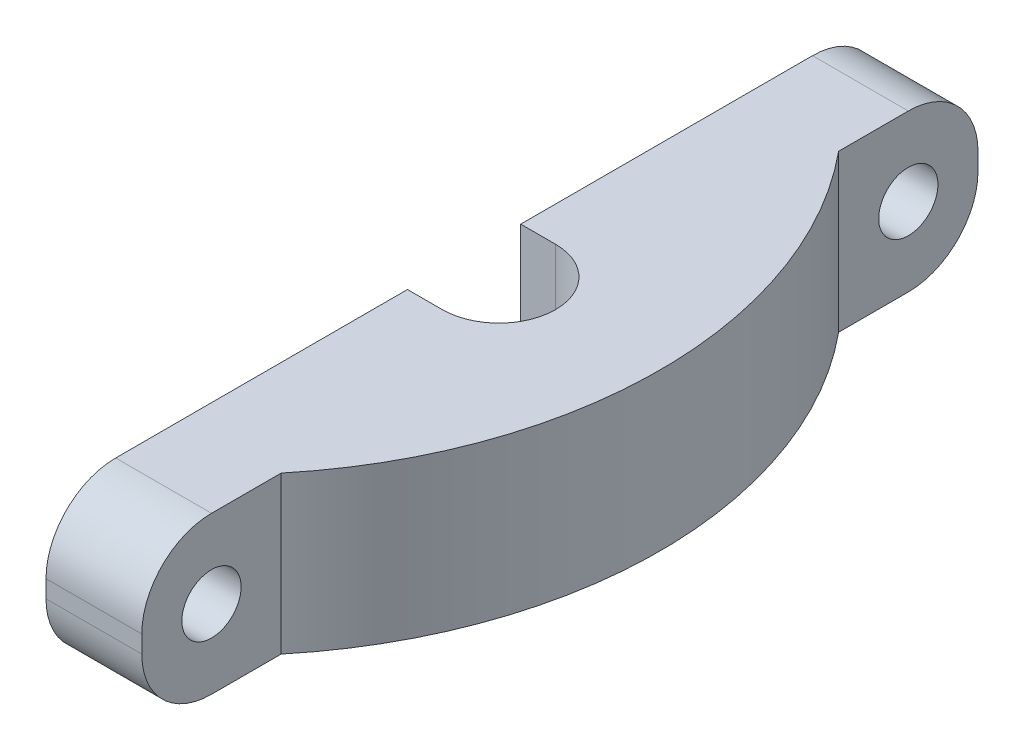
ISO-10303-21;
HEADER;
FILE_DESCRIPTION(('STEP AP214'),'2;1');
FILE_NAME('part.step','',(''),(''),'','','');
FILE_SCHEMA(('AUTOMOTIVE_DESIGN { 1 0 10303 214 1 1 1 1 }'));
ENDSEC;
DATA;
#1=APPLICATION_CONTEXT('core data for automotive mechanical design processes');
#2=APPLICATION_PROTOCOL_DEFINITION('international standard','automotive_design',2000,#1);
#3=PRODUCT_CONTEXT('',#1,'mechanical');
#4=PRODUCT('Part','Part','',(#3));
#5=PRODUCT_RELATED_PRODUCT_CATEGORY('part','',(#4));
#6=PRODUCT_DEFINITION_FORMATION('','',#4);
#7=PRODUCT_DEFINITION_CONTEXT('part definition',#1,'design');
#8=PRODUCT_DEFINITION('design','',#6,#7);
#9=PRODUCT_DEFINITION_SHAPE('','',#8);
#10=(LENGTH_UNIT() NAMED_UNIT(*) SI_UNIT(.MILLI.,.METRE.));
#11=(NAMED_UNIT(*) PLANE_ANGLE_UNIT() SI_UNIT($,.RADIAN.));
#12=(NAMED_UNIT(*) SI_UNIT($,.STERADIAN.) SOLID_ANGLE_UNIT());
#13=UNCERTAINTY_MEASURE_WITH_UNIT(LENGTH_MEASURE(1.E-05),#10,'distance_accuracy_value','');
#14=(GEOMETRIC_REPRESENTATION_CONTEXT(3) GLOBAL_UNCERTAINTY_ASSIGNED_CONTEXT((#13)) GLOBAL_UNIT_ASSIGNED_CONTEXT((#10,
#11,#12)) REPRESENTATION_CONTEXT('',''));
#15=CARTESIAN_POINT('',(0.,0.,0.));
#16=DIRECTION('',(0.,0.,1.));
#17=DIRECTION('',(1.,0.,0.));
#18=AXIS2_PLACEMENT_3D('',#15,#16,#17);
#19=CARTESIAN_POINT('',(11.25,-0.5,-20.));
#20=DIRECTION('',(-1.,0.,0.));
#21=DIRECTION('',(0.,0.,1.));
#22=AXIS2_PLACEMENT_3D('',#19,#20,#21);
#23=CYLINDRICAL_SURFACE('',#22,4.);
#24=CARTESIAN_POINT('',(5.5,-0.5,-20.));
#25=DIRECTION('',(1.,0.,0.));
#26=DIRECTION('',(0.,0.,-1.));
#27=AXIS2_PLACEMENT_3D('',#24,#25,#26);
#28=CIRCLE('',#27,4.);
#29=CARTESIAN_POINT('',(5.5,-4.5,-20.));
#30=VERTEX_POINT('',#29);
#31=CARTESIAN_POINT('',(5.5,-0.499999999999969,-24.));
#32=VERTEX_POINT('',#31);
#33=EDGE_CURVE('E178',#30,#32,#28,.T.);
#34=ORIENTED_EDGE('',*,*,#33,.F.);
#35=DIRECTION('',(-1.,0.,0.));
#36=VECTOR('',#35,1.);
#37=CARTESIAN_POINT('',(11.25,-4.5,-20.));
#38=LINE('',#37,#36);
#39=CARTESIAN_POINT('',(0.,-4.5,-20.));
#40=VERTEX_POINT('',#39);
#41=EDGE_CURVE('E255',#30,#40,#38,.T.);
#42=ORIENTED_EDGE('',*,*,#41,.T.);
#43=CARTESIAN_POINT('',(0.,-0.5,-20.));
#44=DIRECTION('',(1.,0.,0.));
#45=DIRECTION('',(0.,0.,1.));
#46=AXIS2_PLACEMENT_3D('',#43,#44,#45);
#47=CIRCLE('',#46,4.);
#48=CARTESIAN_POINT('',(0.,-0.499999999999969,-24.));
#49=VERTEX_POINT('',#48);
#50=EDGE_CURVE('E235',#40,#49,#47,.T.);
#51=ORIENTED_EDGE('',*,*,#50,.T.);
#52=DIRECTION('',(-1.,0.,0.));
#53=VECTOR('',#52,1.);
#54=CARTESIAN_POINT('',(11.25,-0.499999999999969,-24.));
#55=LINE('',#54,#53);
#56=EDGE_CURVE('E253',#32,#49,#55,.T.);
#57=ORIENTED_EDGE('',*,*,#56,.F.);
#58=EDGE_LOOP('',(#34,#42,#51,#57));
#59=FACE_BOUND('',#58,.T.);
#60=ADVANCED_FACE('F43',(#59),#23,.T.);
#61=CARTESIAN_POINT('',(11.25,0.499999999999974,-24.));
#62=DIRECTION('',(0.,0.,1.));
#63=DIRECTION('',(1.,0.,0.));
#64=AXIS2_PLACEMENT_3D('',#61,#62,#63);
#65=PLANE('',#64);
#66=DIRECTION('',(0.,-1.,0.));
#67=VECTOR('',#66,1.);
#68=CARTESIAN_POINT('',(5.5,4.5,-24.));
#69=LINE('',#68,#67);
#70=CARTESIAN_POINT('',(5.5,0.499999999999999,-24.));
#71=VERTEX_POINT('',#70);
#72=EDGE_CURVE('E171',#71,#32,#69,.T.);
#73=ORIENTED_EDGE('',*,*,#72,.T.);
#74=ORIENTED_EDGE('',*,*,#56,.T.);
#75=DIRECTION('',(0.,1.,0.));
#76=VECTOR('',#75,1.);
#77=CARTESIAN_POINT('',(0.,0.499999999999974,-24.));
#78=LINE('',#77,#76);
#79=CARTESIAN_POINT('',(0.,0.499999999999974,-24.));
#80=VERTEX_POINT('',#79);
#81=EDGE_CURVE('E238',#49,#80,#78,.T.);
#82=ORIENTED_EDGE('',*,*,#81,.T.);
#83=DIRECTION('',(-1.,0.,0.));
#84=VECTOR('',#83,1.);
#85=CARTESIAN_POINT('',(11.25,0.499999999999974,-24.));
#86=LINE('',#85,#84);
#87=EDGE_CURVE('E251',#71,#80,#86,.T.);
#88=ORIENTED_EDGE('',*,*,#87,.F.);
#89=EDGE_LOOP('',(#73,#74,#82,#88));
#90=FACE_BOUND('',#89,.T.);
#91=ADVANCED_FACE('F310',(#90),#65,.F.);
#92=CARTESIAN_POINT('',(11.25,0.499999999999999,-20.));
#93=DIRECTION('',(-1.,0.,0.));
#94=DIRECTION('',(0.,0.,1.));
#95=AXIS2_PLACEMENT_3D('',#92,#93,#94);
#96=CYLINDRICAL_SURFACE('',#95,4.);
#97=CARTESIAN_POINT('',(5.5,0.499999999999999,-20.));
#98=DIRECTION('',(1.,0.,0.));
#99=DIRECTION('',(0.,0.,-1.));
#100=AXIS2_PLACEMENT_3D('',#97,#98,#99);
#101=CIRCLE('',#100,4.);
#102=CARTESIAN_POINT('',(5.5,4.5,-20.));
#103=VERTEX_POINT('',#102);
#104=EDGE_CURVE('E165',#71,#103,#101,.T.);
#105=ORIENTED_EDGE('',*,*,#104,.F.);
#106=ORIENTED_EDGE('',*,*,#87,.T.);
#107=CARTESIAN_POINT('',(0.,0.499999999999999,-20.));
#108=DIRECTION('',(1.,0.,0.));
#109=DIRECTION('',(0.,0.,-1.));
#110=AXIS2_PLACEMENT_3D('',#107,#108,#109);
#111=CIRCLE('',#110,4.);
#112=CARTESIAN_POINT('',(0.,4.5,-20.));
#113=VERTEX_POINT('',#112);
#114=EDGE_CURVE('E241',#80,#113,#111,.T.);
#115=ORIENTED_EDGE('',*,*,#114,.T.);
#116=DIRECTION('',(-1.,0.,0.));
#117=VECTOR('',#116,1.);
#118=CARTESIAN_POINT('',(11.25,4.5,-20.));
#119=LINE('',#118,#117);
#120=EDGE_CURVE('E249',#103,#113,#119,.T.);
#121=ORIENTED_EDGE('',*,*,#120,.F.);
#122=EDGE_LOOP('',(#105,#106,#115,#121));
#123=FACE_BOUND('',#122,.T.);
#124=ADVANCED_FACE('F312',(#123),#96,.T.);
#125=CARTESIAN_POINT('',(11.25,0.,-20.));
#126=DIRECTION('',(1.,0.,0.));
#127=DIRECTION('',(0.,0.,-1.));
#128=AXIS2_PLACEMENT_3D('',#125,#126,#127);
#129=CYLINDRICAL_SURFACE('',#128,1.7);
#130=CARTESIAN_POINT('',(0.,0.,-20.));
#131=DIRECTION('',(1.,0.,0.));
#132=DIRECTION('',(0.,0.,-1.));
#133=AXIS2_PLACEMENT_3D('',#130,#131,#132);
#134=CIRCLE('',#133,1.7);
#135=CARTESIAN_POINT('',(0.,0.,-21.7));
#136=VERTEX_POINT('',#135);
#137=EDGE_CURVE('E196',#136,#136,#134,.T.);
#138=ORIENTED_EDGE('',*,*,#137,.F.);
#139=EDGE_LOOP('',(#138));
#140=FACE_BOUND('',#139,.T.);
#141=CARTESIAN_POINT('',(5.5,0.,-20.));
#142=DIRECTION('',(1.,0.,0.));
#143=DIRECTION('',(0.,0.,-1.));
#144=AXIS2_PLACEMENT_3D('',#141,#142,#143);
#145=CIRCLE('',#144,1.7);
#146=CARTESIAN_POINT('',(5.5,0.,-21.7));
#147=VERTEX_POINT('',#146);
#148=EDGE_CURVE('E47',#147,#147,#145,.F.);
#149=ORIENTED_EDGE('',*,*,#148,.F.);
#150=EDGE_LOOP('',(#149));
#151=FACE_BOUND('',#150,.T.);
#152=ADVANCED_FACE('F343',(#140,#151),#129,.F.);
#153=CARTESIAN_POINT('',(0.,0.5,20.));
#154=DIRECTION('',(-1.,0.,0.));
#155=DIRECTION('',(0.,0.,1.));
#156=AXIS2_PLACEMENT_3D('',#153,#154,#155);
#157=PLANE('',#156);
#158=ORIENTED_EDGE('',*,*,#137,.T.);
#159=EDGE_LOOP('',(#158));
#160=FACE_BOUND('',#159,.T.);
#161=DIRECTION('',(0.,-1.,0.));
#162=VECTOR('',#161,1.);
#163=CARTESIAN_POINT('',(0.,4.5,-3.25));
#164=LINE('',#163,#162);
#165=CARTESIAN_POINT('',(0.,4.5,-3.25));
#166=VERTEX_POINT('',#165);
#167=CARTESIAN_POINT('',(0.,-4.5,-3.25));
#168=VERTEX_POINT('',#167);
#169=EDGE_CURVE('E219',#166,#168,#164,.T.);
#170=ORIENTED_EDGE('',*,*,#169,.F.);
#171=DIRECTION('',(0.,0.,1.));
#172=VECTOR('',#171,1.);
#173=CARTESIAN_POINT('',(0.,4.5,-20.));
#174=LINE('',#173,#172);
#175=EDGE_CURVE('E245',#113,#166,#174,.T.);
#176=ORIENTED_EDGE('',*,*,#175,.F.);
#177=ORIENTED_EDGE('',*,*,#114,.F.);
#178=ORIENTED_EDGE('',*,*,#81,.F.);
#179=ORIENTED_EDGE('',*,*,#50,.F.);
#180=DIRECTION('',(0.,0.,-1.));
#181=VECTOR('',#180,1.);
#182=CARTESIAN_POINT('',(0.,-4.5,20.));
#183=LINE('',#182,#181);
#184=EDGE_CURVE('E231',#168,#40,#183,.T.);
#185=ORIENTED_EDGE('',*,*,#184,.F.);
#186=EDGE_LOOP('',(#170,#176,#177,#178,#179,#185));
#187=FACE_BOUND('',#186,.T.);
#188=ADVANCED_FACE('F301',(#160,#187),#157,.T.);
#189=CARTESIAN_POINT('',(11.25,0.5,20.));
#190=DIRECTION('',(-1.,0.,0.));
#191=DIRECTION('',(0.,0.,1.));
#192=AXIS2_PLACEMENT_3D('',#189,#190,#191);
#193=CYLINDRICAL_SURFACE('',#192,4.);
#194=DIRECTION('',(-1.,0.,0.));
#195=VECTOR('',#194,1.);
#196=CARTESIAN_POINT('',(11.25,0.499999999999969,24.));
#197=LINE('',#196,#195);
#198=CARTESIAN_POINT('',(5.5,0.499999999999969,24.));
#199=VERTEX_POINT('',#198);
#200=CARTESIAN_POINT('',(0.,0.499999999999969,24.));
#201=VERTEX_POINT('',#200);
#202=EDGE_CURVE('E11',#199,#201,#197,.T.);
#203=ORIENTED_EDGE('',*,*,#202,.F.);
#204=CARTESIAN_POINT('',(5.5,0.5,20.));
#205=DIRECTION('',(-1.,0.,0.));
#206=DIRECTION('',(0.,0.,1.));
#207=AXIS2_PLACEMENT_3D('',#204,#205,#206);
#208=CIRCLE('',#207,4.);
#209=CARTESIAN_POINT('',(5.5,4.5,20.));
#210=VERTEX_POINT('',#209);
#211=EDGE_CURVE('E191',#199,#210,#208,.T.);
#212=ORIENTED_EDGE('',*,*,#211,.T.);
#213=DIRECTION('',(-1.,0.,0.));
#214=VECTOR('',#213,1.);
#215=CARTESIAN_POINT('',(11.25,4.5,20.));
#216=LINE('',#215,#214);
#217=CARTESIAN_POINT('',(0.,4.5,20.));
#218=VERTEX_POINT('',#217);
#219=EDGE_CURVE('E68',#210,#218,#216,.T.);
#220=ORIENTED_EDGE('',*,*,#219,.T.);
#221=CARTESIAN_POINT('',(0.,0.5,20.));
#222=DIRECTION('',(1.,0.,0.));
#223=DIRECTION('',(0.,0.,1.));
#224=AXIS2_PLACEMENT_3D('',#221,#222,#223);
#225=CIRCLE('',#224,4.);
#226=EDGE_CURVE('E218',#218,#201,#225,.T.);
#227=ORIENTED_EDGE('',*,*,#226,.T.);
#228=EDGE_LOOP('',(#203,#212,#220,#227));
#229=FACE_BOUND('',#228,.T.);
#230=ADVANCED_FACE('F45',(#229),#193,.T.);
#231=CARTESIAN_POINT('',(11.25,0.499999999999969,24.));
#232=DIRECTION('',(0.,0.,-1.));
#233=DIRECTION('',(-1.,0.,0.));
#234=AXIS2_PLACEMENT_3D('',#231,#232,#233);
#235=PLANE('',#234);
#236=DIRECTION('',(-1.,0.,0.));
#237=VECTOR('',#236,1.);
#238=CARTESIAN_POINT('',(11.25,-0.499999999999974,24.));
#239=LINE('',#238,#237);
#240=CARTESIAN_POINT('',(5.5,-0.499999999999999,24.));
#241=VERTEX_POINT('',#240);
#242=CARTESIAN_POINT('',(0.,-0.499999999999974,24.));
#243=VERTEX_POINT('',#242);
#244=EDGE_CURVE('E52',#241,#243,#239,.T.);
#245=ORIENTED_EDGE('',*,*,#244,.F.);
#246=DIRECTION('',(0.,-1.,0.));
#247=VECTOR('',#246,1.);
#248=CARTESIAN_POINT('',(5.5,4.5,24.));
#249=LINE('',#248,#247);
#250=EDGE_CURVE('E157',#199,#241,#249,.T.);
#251=ORIENTED_EDGE('',*,*,#250,.F.);
#252=ORIENTED_EDGE('',*,*,#202,.T.);
#253=DIRECTION('',(0.,-1.,0.));
#254=VECTOR('',#253,1.);
#255=CARTESIAN_POINT('',(0.,0.499999999999969,24.));
#256=LINE('',#255,#254);
#257=EDGE_CURVE('E225',#201,#243,#256,.T.);
#258=ORIENTED_EDGE('',*,*,#257,.T.);
#259=EDGE_LOOP('',(#245,#251,#252,#258));
#260=FACE_BOUND('',#259,.T.);
#261=ADVANCED_FACE('F277',(#260),#235,.F.);
#262=CARTESIAN_POINT('',(11.25,-0.499999999999999,20.));
#263=DIRECTION('',(-1.,0.,0.));
#264=DIRECTION('',(0.,0.,1.));
#265=AXIS2_PLACEMENT_3D('',#262,#263,#264);
#266=CYLINDRICAL_SURFACE('',#265,4.);
#267=DIRECTION('',(-1.,0.,0.));
#268=VECTOR('',#267,1.);
#269=CARTESIAN_POINT('',(11.25,-4.5,20.));
#270=LINE('',#269,#268);
#271=CARTESIAN_POINT('',(5.5,-4.5,20.));
#272=VERTEX_POINT('',#271);
#273=CARTESIAN_POINT('',(0.,-4.5,20.));
#274=VERTEX_POINT('',#273);
#275=EDGE_CURVE('E257',#272,#274,#270,.T.);
#276=ORIENTED_EDGE('',*,*,#275,.F.);
#277=CARTESIAN_POINT('',(5.5,-0.499999999999999,20.));
#278=DIRECTION('',(-1.,0.,0.));
#279=DIRECTION('',(0.,0.,1.));
#280=AXIS2_PLACEMENT_3D('',#277,#278,#279);
#281=CIRCLE('',#280,4.);
#282=EDGE_CURVE('E188',#272,#241,#281,.T.);
#283=ORIENTED_EDGE('',*,*,#282,.T.);
#284=ORIENTED_EDGE('',*,*,#244,.T.);
#285=CARTESIAN_POINT('',(0.,-0.499999999999999,20.));
#286=DIRECTION('',(1.,0.,0.));
#287=DIRECTION('',(0.,0.,-1.));
#288=AXIS2_PLACEMENT_3D('',#285,#286,#287);
#289=CIRCLE('',#288,4.);
#290=EDGE_CURVE('E228',#243,#274,#289,.T.);
#291=ORIENTED_EDGE('',*,*,#290,.T.);
#292=EDGE_LOOP('',(#276,#283,#284,#291));
#293=FACE_BOUND('',#292,.T.);
#294=ADVANCED_FACE('F276',(#293),#266,.T.);
#295=CARTESIAN_POINT('',(11.25,-4.5,20.));
#296=DIRECTION('',(0.,1.,0.));
#297=DIRECTION('',(0.,0.,1.));
#298=AXIS2_PLACEMENT_3D('',#295,#296,#297);
#299=PLANE('',#298);
#300=DIRECTION('',(0.,0.,1.));
#301=VECTOR('',#300,1.);
#302=CARTESIAN_POINT('',(5.50000000000002,-4.5,0.));
#303=LINE('',#302,#301);
#304=CARTESIAN_POINT('',(5.50000000000001,-4.5,-16.));
#305=VERTEX_POINT('',#304);
#306=EDGE_CURVE('E166',#30,#305,#303,.T.);
#307=ORIENTED_EDGE('',*,*,#306,.T.);
#308=CARTESIAN_POINT('',(-13.8858695652174,-4.5,0.));
#309=DIRECTION('',(0.,-1.,0.));
#310=DIRECTION('',(0.,0.,-1.));
#311=AXIS2_PLACEMENT_3D('',#308,#309,#310);
#312=CIRCLE('',#311,25.1358695652174);
#313=CARTESIAN_POINT('',(5.5,-4.5,16.));
#314=VERTEX_POINT('',#313);
#315=EDGE_CURVE('E170',#314,#305,#312,.F.);
#316=ORIENTED_EDGE('',*,*,#315,.F.);
#317=DIRECTION('',(0.,0.,-1.));
#318=VECTOR('',#317,1.);
#319=CARTESIAN_POINT('',(5.5,-4.5,0.));
#320=LINE('',#319,#318);
#321=EDGE_CURVE('E180',#272,#314,#320,.T.);
#322=ORIENTED_EDGE('',*,*,#321,.F.);
#323=ORIENTED_EDGE('',*,*,#275,.T.);
#324=CARTESIAN_POINT('',(0.,-4.5,3.25));
#325=VERTEX_POINT('',#324);
#326=EDGE_CURVE('E232',#274,#325,#183,.T.);
#327=ORIENTED_EDGE('',*,*,#326,.T.);
#328=DIRECTION('',(-1.,0.,0.));
#329=VECTOR('',#328,1.);
#330=CARTESIAN_POINT('',(2.,-4.5,3.25));
#331=LINE('',#330,#329);
#332=CARTESIAN_POINT('',(2.,-4.5,3.25));
#333=VERTEX_POINT('',#332);
#334=EDGE_CURVE('E60',#333,#325,#331,.T.);
#335=ORIENTED_EDGE('',*,*,#334,.F.);
#336=CARTESIAN_POINT('',(2.,-4.5,0.));
#337=DIRECTION('',(0.,-1.,0.));
#338=DIRECTION('',(0.,0.,-1.));
#339=AXIS2_PLACEMENT_3D('',#336,#337,#338);
#340=CIRCLE('',#339,3.25);
#341=CARTESIAN_POINT('',(2.,-4.5,-3.25));
#342=VERTEX_POINT('',#341);
#343=EDGE_CURVE('E199',#342,#333,#340,.T.);
#344=ORIENTED_EDGE('',*,*,#343,.F.);
#345=DIRECTION('',(1.,0.,0.));
#346=VECTOR('',#345,1.);
#347=CARTESIAN_POINT('',(2.,-4.5,-3.25));
#348=LINE('',#347,#346);
#349=EDGE_CURVE('E204',#168,#342,#348,.T.);
#350=ORIENTED_EDGE('',*,*,#349,.F.);
#351=ORIENTED_EDGE('',*,*,#184,.T.);
#352=ORIENTED_EDGE('',*,*,#41,.F.);
#353=EDGE_LOOP('',(#307,#316,#322,#323,#327,#335,#344,#350,#351,#352));
#354=FACE_BOUND('',#353,.T.);
#355=ADVANCED_FACE('F286',(#354),#299,.F.);
#356=CARTESIAN_POINT('',(11.25,4.5,-20.));
#357=DIRECTION('',(0.,-1.,0.));
#358=DIRECTION('',(0.,0.,-1.));
#359=AXIS2_PLACEMENT_3D('',#356,#357,#358);
#360=PLANE('',#359);
#361=DIRECTION('',(0.,0.,1.));
#362=VECTOR('',#361,1.);
#363=CARTESIAN_POINT('',(5.50000000000002,4.5,0.));
#364=LINE('',#363,#362);
#365=CARTESIAN_POINT('',(5.50000000000001,4.5,-16.));
#366=VERTEX_POINT('',#365);
#367=EDGE_CURVE('E151',#103,#366,#364,.T.);
#368=ORIENTED_EDGE('',*,*,#367,.F.);
#369=ORIENTED_EDGE('',*,*,#120,.T.);
#370=ORIENTED_EDGE('',*,*,#175,.T.);
#371=DIRECTION('',(1.,0.,0.));
#372=VECTOR('',#371,1.);
#373=CARTESIAN_POINT('',(2.,4.5,-3.25));
#374=LINE('',#373,#372);
#375=CARTESIAN_POINT('',(2.,4.5,-3.25));
#376=VERTEX_POINT('',#375);
#377=EDGE_CURVE('E207',#166,#376,#374,.T.);
#378=ORIENTED_EDGE('',*,*,#377,.T.);
#379=CARTESIAN_POINT('',(2.,4.5,0.));
#380=DIRECTION('',(0.,-1.,0.));
#381=DIRECTION('',(0.,0.,-1.));
#382=AXIS2_PLACEMENT_3D('',#379,#380,#381);
#383=CIRCLE('',#382,3.25);
#384=CARTESIAN_POINT('',(2.,4.5,3.25));
#385=VERTEX_POINT('',#384);
#386=EDGE_CURVE('E200',#376,#385,#383,.T.);
#387=ORIENTED_EDGE('',*,*,#386,.T.);
#388=DIRECTION('',(-1.,0.,0.));
#389=VECTOR('',#388,1.);
#390=CARTESIAN_POINT('',(2.,4.5,3.25));
#391=LINE('',#390,#389);
#392=CARTESIAN_POINT('',(0.,4.5,3.25));
#393=VERTEX_POINT('',#392);
#394=EDGE_CURVE('E203',#385,#393,#391,.T.);
#395=ORIENTED_EDGE('',*,*,#394,.T.);
#396=EDGE_CURVE('E244',#393,#218,#174,.T.);
#397=ORIENTED_EDGE('',*,*,#396,.T.);
#398=ORIENTED_EDGE('',*,*,#219,.F.);
#399=DIRECTION('',(0.,0.,-1.));
#400=VECTOR('',#399,1.);
#401=CARTESIAN_POINT('',(5.5,4.5,0.));
#402=LINE('',#401,#400);
#403=CARTESIAN_POINT('',(5.5,4.5,16.));
#404=VERTEX_POINT('',#403);
#405=EDGE_CURVE('E153',#210,#404,#402,.T.);
#406=ORIENTED_EDGE('',*,*,#405,.T.);
#407=CARTESIAN_POINT('',(-13.8858695652174,4.5,0.));
#408=DIRECTION('',(0.,-1.,0.));
#409=DIRECTION('',(0.,0.,-1.));
#410=AXIS2_PLACEMENT_3D('',#407,#408,#409);
#411=CIRCLE('',#410,25.1358695652174);
#412=EDGE_CURVE('E148',#404,#366,#411,.F.);
#413=ORIENTED_EDGE('',*,*,#412,.T.);
#414=EDGE_LOOP('',(#368,#369,#370,#378,#387,#395,#397,#398,#406,#413));
#415=FACE_BOUND('',#414,.T.);
#416=ADVANCED_FACE('F150',(#415),#360,.F.);
#417=CARTESIAN_POINT('',(0.,0.,20.));
#418=DIRECTION('',(1.,0.,0.));
#419=DIRECTION('',(0.,0.,-1.));
#420=AXIS2_PLACEMENT_3D('',#417,#418,#419);
#421=CIRCLE('',#420,1.7);
#422=CARTESIAN_POINT('',(0.,0.,18.3));
#423=VERTEX_POINT('',#422);
#424=EDGE_CURVE('E193',#423,#423,#421,.T.);
#425=ORIENTED_EDGE('',*,*,#424,.T.);
#426=EDGE_LOOP('',(#425));
#427=FACE_BOUND('',#426,.T.);
#428=DIRECTION('',(0.,-1.,0.));
#429=VECTOR('',#428,1.);
#430=CARTESIAN_POINT('',(0.,4.5,3.25));
#431=LINE('',#430,#429);
#432=EDGE_CURVE('E221',#393,#325,#431,.T.);
#433=ORIENTED_EDGE('',*,*,#432,.T.);
#434=ORIENTED_EDGE('',*,*,#326,.F.);
#435=ORIENTED_EDGE('',*,*,#290,.F.);
#436=ORIENTED_EDGE('',*,*,#257,.F.);
#437=ORIENTED_EDGE('',*,*,#226,.F.);
#438=ORIENTED_EDGE('',*,*,#396,.F.);
#439=EDGE_LOOP('',(#433,#434,#435,#436,#437,#438));
#440=FACE_BOUND('',#439,.T.);
#441=ADVANCED_FACE('F283',(#427,#440),#157,.T.);
#442=CARTESIAN_POINT('',(2.,4.5,0.));
#443=DIRECTION('',(0.,-1.,0.));
#444=DIRECTION('',(0.,0.,-1.));
#445=AXIS2_PLACEMENT_3D('',#442,#443,#444);
#446=CYLINDRICAL_SURFACE('',#445,3.25);
#447=ORIENTED_EDGE('',*,*,#343,.T.);
#448=DIRECTION('',(0.,-1.,0.));
#449=VECTOR('',#448,1.);
#450=CARTESIAN_POINT('',(2.,4.5,3.25));
#451=LINE('',#450,#449);
#452=EDGE_CURVE('E210',#385,#333,#451,.T.);
#453=ORIENTED_EDGE('',*,*,#452,.F.);
#454=ORIENTED_EDGE('',*,*,#386,.F.);
#455=DIRECTION('',(0.,-1.,0.));
#456=VECTOR('',#455,1.);
#457=CARTESIAN_POINT('',(2.,4.5,-3.25));
#458=LINE('',#457,#456);
#459=EDGE_CURVE('E216',#376,#342,#458,.T.);
#460=ORIENTED_EDGE('',*,*,#459,.T.);
#461=EDGE_LOOP('',(#447,#453,#454,#460));
#462=FACE_BOUND('',#461,.T.);
#463=ADVANCED_FACE('F292',(#462),#446,.F.);
#464=CARTESIAN_POINT('',(2.,4.5,-3.25));
#465=DIRECTION('',(0.,0.,-1.));
#466=DIRECTION('',(-1.,0.,0.));
#467=AXIS2_PLACEMENT_3D('',#464,#465,#466);
#468=PLANE('',#467);
#469=ORIENTED_EDGE('',*,*,#349,.T.);
#470=ORIENTED_EDGE('',*,*,#459,.F.);
#471=ORIENTED_EDGE('',*,*,#377,.F.);
#472=ORIENTED_EDGE('',*,*,#169,.T.);
#473=EDGE_LOOP('',(#469,#470,#471,#472));
#474=FACE_BOUND('',#473,.T.);
#475=ADVANCED_FACE('F313',(#474),#468,.F.);
#476=CARTESIAN_POINT('',(2.,4.5,3.25));
#477=DIRECTION('',(0.,0.,1.));
#478=DIRECTION('',(1.,0.,0.));
#479=AXIS2_PLACEMENT_3D('',#476,#477,#478);
#480=PLANE('',#479);
#481=ORIENTED_EDGE('',*,*,#334,.T.);
#482=ORIENTED_EDGE('',*,*,#432,.F.);
#483=ORIENTED_EDGE('',*,*,#394,.F.);
#484=ORIENTED_EDGE('',*,*,#452,.T.);
#485=EDGE_LOOP('',(#481,#482,#483,#484));
#486=FACE_BOUND('',#485,.T.);
#487=ADVANCED_FACE('F290',(#486),#480,.F.);
#488=CARTESIAN_POINT('',(11.25,0.,20.));
#489=DIRECTION('',(1.,0.,0.));
#490=DIRECTION('',(0.,0.,-1.));
#491=AXIS2_PLACEMENT_3D('',#488,#489,#490);
#492=CYLINDRICAL_SURFACE('',#491,1.7);
#493=CARTESIAN_POINT('',(5.5,0.,20.));
#494=DIRECTION('',(-1.,0.,0.));
#495=DIRECTION('',(0.,0.,1.));
#496=AXIS2_PLACEMENT_3D('',#493,#494,#495);
#497=CIRCLE('',#496,1.7);
#498=CARTESIAN_POINT('',(5.5,0.,21.7));
#499=VERTEX_POINT('',#498);
#500=EDGE_CURVE('E186',#499,#499,#497,.F.);
#501=ORIENTED_EDGE('',*,*,#500,.T.);
#502=EDGE_LOOP('',(#501));
#503=FACE_BOUND('',#502,.T.);
#504=ORIENTED_EDGE('',*,*,#424,.F.);
#505=EDGE_LOOP('',(#504));
#506=FACE_BOUND('',#505,.T.);
#507=ADVANCED_FACE('F262',(#503,#506),#492,.F.);
#508=CARTESIAN_POINT('',(5.5,4.5,0.));
#509=DIRECTION('',(-1.,0.,0.));
#510=DIRECTION('',(0.,0.,1.));
#511=AXIS2_PLACEMENT_3D('',#508,#509,#510);
#512=PLANE('',#511);
#513=ORIENTED_EDGE('',*,*,#500,.F.);
#514=EDGE_LOOP('',(#513));
#515=FACE_BOUND('',#514,.T.);
#516=ORIENTED_EDGE('',*,*,#250,.T.);
#517=ORIENTED_EDGE('',*,*,#282,.F.);
#518=ORIENTED_EDGE('',*,*,#321,.T.);
#519=DIRECTION('',(0.,-1.,0.));
#520=VECTOR('',#519,1.);
#521=CARTESIAN_POINT('',(5.5,4.5,16.));
#522=LINE('',#521,#520);
#523=EDGE_CURVE('E184',#404,#314,#522,.T.);
#524=ORIENTED_EDGE('',*,*,#523,.F.);
#525=ORIENTED_EDGE('',*,*,#405,.F.);
#526=ORIENTED_EDGE('',*,*,#211,.F.);
#527=EDGE_LOOP('',(#516,#517,#518,#524,#525,#526));
#528=FACE_BOUND('',#527,.T.);
#529=ADVANCED_FACE('F265',(#515,#528),#512,.F.);
#530=CARTESIAN_POINT('',(-13.8858695652174,4.5,0.));
#531=DIRECTION('',(0.,-1.,0.));
#532=DIRECTION('',(0.,0.,-1.));
#533=AXIS2_PLACEMENT_3D('',#530,#531,#532);
#534=CYLINDRICAL_SURFACE('',#533,25.1358695652174);
#535=ORIENTED_EDGE('',*,*,#315,.T.);
#536=DIRECTION('',(0.,-1.,0.));
#537=VECTOR('',#536,1.);
#538=CARTESIAN_POINT('',(5.50000000000001,4.5,-16.));
#539=LINE('',#538,#537);
#540=EDGE_CURVE('E162',#366,#305,#539,.T.);
#541=ORIENTED_EDGE('',*,*,#540,.F.);
#542=ORIENTED_EDGE('',*,*,#412,.F.);
#543=ORIENTED_EDGE('',*,*,#523,.T.);
#544=EDGE_LOOP('',(#535,#541,#542,#543));
#545=FACE_BOUND('',#544,.T.);
#546=ADVANCED_FACE('F168',(#545),#534,.T.);
#547=CARTESIAN_POINT('',(5.50000000000002,4.5,0.));
#548=DIRECTION('',(1.,0.,0.));
#549=DIRECTION('',(0.,0.,-1.));
#550=AXIS2_PLACEMENT_3D('',#547,#548,#549);
#551=PLANE('',#550);
#552=ORIENTED_EDGE('',*,*,#148,.T.);
#553=EDGE_LOOP('',(#552));
#554=FACE_BOUND('',#553,.T.);
#555=ORIENTED_EDGE('',*,*,#33,.T.);
#556=ORIENTED_EDGE('',*,*,#72,.F.);
#557=ORIENTED_EDGE('',*,*,#104,.T.);
#558=ORIENTED_EDGE('',*,*,#367,.T.);
#559=ORIENTED_EDGE('',*,*,#540,.T.);
#560=ORIENTED_EDGE('',*,*,#306,.F.);
#561=EDGE_LOOP('',(#555,#556,#557,#558,#559,#560));
#562=FACE_BOUND('',#561,.T.);
#563=ADVANCED_FACE('F161',(#554,#562),#551,.T.);
#564=CLOSED_SHELL('',(#60,#91,#124,#152,#188,#230,#261,#294,#355,#416,#441,#463,#475,#487,#507,
#529,#546,#563));
#565=MANIFOLD_SOLID_BREP('B2',#564);
#566=ADVANCED_BREP_SHAPE_REPRESENTATION('',(#18,#565),#14);
#567=SHAPE_DEFINITION_REPRESENTATION(#9,#566);
ENDSEC;
END-ISO-10303-21;
